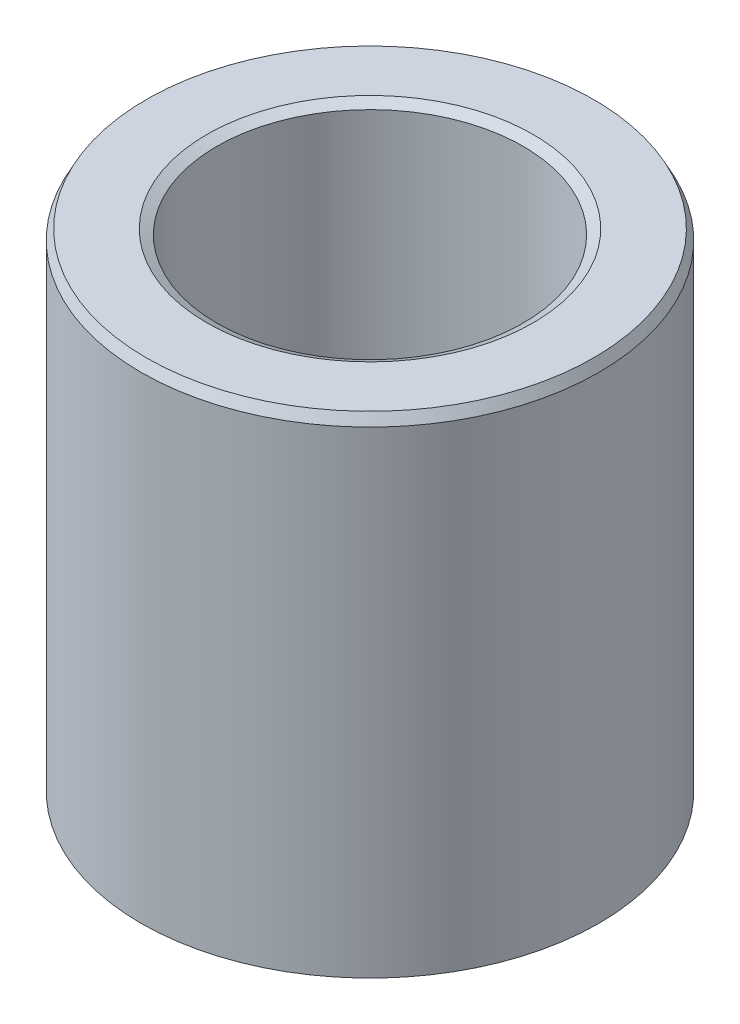
ISO-10303-21;
HEADER;
FILE_DESCRIPTION(('STEP AP214'),'2;1');
FILE_NAME('part.step','',(''),(''),'','','');
FILE_SCHEMA(('AUTOMOTIVE_DESIGN { 1 0 10303 214 1 1 1 1 }'));
ENDSEC;
DATA;
#1=APPLICATION_CONTEXT('core data for automotive mechanical design processes');
#2=APPLICATION_PROTOCOL_DEFINITION('international standard','automotive_design',2000,#1);
#3=PRODUCT_CONTEXT('',#1,'mechanical');
#4=PRODUCT('Part','Part','',(#3));
#5=PRODUCT_RELATED_PRODUCT_CATEGORY('part','',(#4));
#6=PRODUCT_DEFINITION_FORMATION('','',#4);
#7=PRODUCT_DEFINITION_CONTEXT('part definition',#1,'design');
#8=PRODUCT_DEFINITION('design','',#6,#7);
#9=PRODUCT_DEFINITION_SHAPE('','',#8);
#10=(LENGTH_UNIT() NAMED_UNIT(*) SI_UNIT(.MILLI.,.METRE.));
#11=(NAMED_UNIT(*) PLANE_ANGLE_UNIT() SI_UNIT($,.RADIAN.));
#12=(NAMED_UNIT(*) SI_UNIT($,.STERADIAN.) SOLID_ANGLE_UNIT());
#13=UNCERTAINTY_MEASURE_WITH_UNIT(LENGTH_MEASURE(1.E-05),#10,'distance_accuracy_value','');
#14=(GEOMETRIC_REPRESENTATION_CONTEXT(3) GLOBAL_UNCERTAINTY_ASSIGNED_CONTEXT((#13)) GLOBAL_UNIT_ASSIGNED_CONTEXT((#10,
#11,#12)) REPRESENTATION_CONTEXT('',''));
#15=CARTESIAN_POINT('',(0.,0.,0.));
#16=DIRECTION('',(0.,0.,1.));
#17=DIRECTION('',(1.,0.,0.));
#18=AXIS2_PLACEMENT_3D('',#15,#16,#17);
#19=CARTESIAN_POINT('',(0.,107.539626677391,0.));
#20=DIRECTION('',(0.,-1.,0.));
#21=DIRECTION('',(0.,0.,-1.));
#22=AXIS2_PLACEMENT_3D('',#19,#20,#21);
#23=CYLINDRICAL_SURFACE('',#22,50.);
#24=CARTESIAN_POINT('',(0.,1.13854864580681,0.));
#25=DIRECTION('',(0.,1.,0.));
#26=DIRECTION('',(0.,0.,1.));
#27=AXIS2_PLACEMENT_3D('',#24,#25,#26);
#28=CIRCLE('',#27,50.);
#29=CARTESIAN_POINT('',(0.,1.13854864580681,50.));
#30=VERTEX_POINT('',#29);
#31=EDGE_CURVE('E10',#30,#30,#28,.T.);
#32=ORIENTED_EDGE('',*,*,#31,.T.);
#33=EDGE_LOOP('',(#32));
#34=FACE_BOUND('',#33,.T.);
#35=CARTESIAN_POINT('',(0.,105.355182467018,0.));
#36=DIRECTION('',(0.,1.,0.));
#37=DIRECTION('',(0.,0.,1.));
#38=AXIS2_PLACEMENT_3D('',#35,#36,#37);
#39=CIRCLE('',#38,50.);
#40=CARTESIAN_POINT('',(0.,105.355182467018,50.));
#41=VERTEX_POINT('',#40);
#42=EDGE_CURVE('E50',#41,#41,#39,.F.);
#43=ORIENTED_EDGE('',*,*,#42,.T.);
#44=EDGE_LOOP('',(#43));
#45=FACE_BOUND('',#44,.T.);
#46=ADVANCED_FACE('F39',(#34,#45),#23,.T.);
#47=CARTESIAN_POINT('',(0.,107.539626677391,0.));
#48=DIRECTION('',(0.,1.,0.));
#49=DIRECTION('',(0.,0.,1.));
#50=AXIS2_PLACEMENT_3D('',#47,#48,#49);
#51=PLANE('',#50);
#52=CARTESIAN_POINT('',(0.,107.539626677391,0.));
#53=DIRECTION('',(0.,1.,0.));
#54=DIRECTION('',(0.,0.,1.));
#55=AXIS2_PLACEMENT_3D('',#52,#53,#54);
#56=CIRCLE('',#55,35.6407967585766);
#57=CARTESIAN_POINT('',(0.,107.539626677391,35.6407967585766));
#58=VERTEX_POINT('',#57);
#59=EDGE_CURVE('E58',#58,#58,#56,.F.);
#60=ORIENTED_EDGE('',*,*,#59,.T.);
#61=EDGE_LOOP('',(#60));
#62=FACE_BOUND('',#61,.T.);
#63=CARTESIAN_POINT('',(0.,107.539626677391,0.));
#64=DIRECTION('',(0.,1.,0.));
#65=DIRECTION('',(0.,0.,1.));
#66=AXIS2_PLACEMENT_3D('',#63,#64,#65);
#67=CIRCLE('',#66,48.8614513541932);
#68=CARTESIAN_POINT('',(0.,107.539626677391,48.8614513541932));
#69=VERTEX_POINT('',#68);
#70=EDGE_CURVE('E61',#69,#69,#67,.T.);
#71=ORIENTED_EDGE('',*,*,#70,.T.);
#72=EDGE_LOOP('',(#71));
#73=FACE_BOUND('',#72,.T.);
#74=ADVANCED_FACE('F88',(#62,#73),#51,.T.);
#75=CARTESIAN_POINT('',(0.,0.,0.));
#76=DIRECTION('',(0.,1.,0.));
#77=DIRECTION('',(0.,0.,1.));
#78=AXIS2_PLACEMENT_3D('',#75,#76,#77);
#79=PLANE('',#78);
#80=CARTESIAN_POINT('',(0.,0.,0.));
#81=DIRECTION('',(0.,1.,0.));
#82=DIRECTION('',(0.,0.,1.));
#83=AXIS2_PLACEMENT_3D('',#80,#81,#82);
#84=CIRCLE('',#83,34.5949011940108);
#85=CARTESIAN_POINT('',(0.,0.,34.5949011940108));
#86=VERTEX_POINT('',#85);
#87=EDGE_CURVE('E51',#86,#86,#84,.T.);
#88=ORIENTED_EDGE('',*,*,#87,.T.);
#89=EDGE_LOOP('',(#88));
#90=FACE_BOUND('',#89,.T.);
#91=CARTESIAN_POINT('',(0.,0.,0.));
#92=DIRECTION('',(0.,1.,0.));
#93=DIRECTION('',(0.,0.,1.));
#94=AXIS2_PLACEMENT_3D('',#91,#92,#93);
#95=CIRCLE('',#94,47.8155557896274);
#96=CARTESIAN_POINT('',(0.,0.,47.8155557896274));
#97=VERTEX_POINT('',#96);
#98=EDGE_CURVE('E54',#97,#97,#95,.F.);
#99=ORIENTED_EDGE('',*,*,#98,.T.);
#100=EDGE_LOOP('',(#99));
#101=FACE_BOUND('',#100,.T.);
#102=ADVANCED_FACE('F83',(#90,#101),#79,.F.);
#103=CARTESIAN_POINT('',(0.,107.539626677391,0.));
#104=DIRECTION('',(0.,-1.,0.));
#105=DIRECTION('',(0.,0.,-1.));
#106=AXIS2_PLACEMENT_3D('',#103,#104,#105);
#107=CYLINDRICAL_SURFACE('',#106,33.456352548204);
#108=CARTESIAN_POINT('',(0.,106.401078031584,0.));
#109=DIRECTION('',(0.,1.,0.));
#110=DIRECTION('',(0.,0.,1.));
#111=AXIS2_PLACEMENT_3D('',#108,#109,#110);
#112=CIRCLE('',#111,33.456352548204);
#113=CARTESIAN_POINT('',(0.,106.401078031584,33.456352548204));
#114=VERTEX_POINT('',#113);
#115=EDGE_CURVE('E67',#114,#114,#112,.T.);
#116=ORIENTED_EDGE('',*,*,#115,.T.);
#117=EDGE_LOOP('',(#116));
#118=FACE_BOUND('',#117,.T.);
#119=CARTESIAN_POINT('',(0.,2.18444421037264,0.));
#120=DIRECTION('',(0.,1.,0.));
#121=DIRECTION('',(0.,0.,1.));
#122=AXIS2_PLACEMENT_3D('',#119,#120,#121);
#123=CIRCLE('',#122,33.456352548204);
#124=CARTESIAN_POINT('',(0.,2.18444421037264,33.456352548204));
#125=VERTEX_POINT('',#124);
#126=EDGE_CURVE('E69',#125,#125,#123,.F.);
#127=ORIENTED_EDGE('',*,*,#126,.T.);
#128=EDGE_LOOP('',(#127));
#129=FACE_BOUND('',#128,.T.);
#130=ADVANCED_FACE('F71',(#118,#129),#107,.F.);
#131=CARTESIAN_POINT('',(0.,106.401078031584,0.));
#132=DIRECTION('',(0.,1.,0.));
#133=DIRECTION('',(0.,0.,1.));
#134=AXIS2_PLACEMENT_3D('',#131,#132,#133);
#135=CONICAL_SURFACE('',#134,33.456352548204,1.09032703819195);
#136=CARTESIAN_POINT('',(0.,107.539626677391,35.6407967585766));
#137=CARTESIAN_POINT('',(0.,107.527766795664,35.6180421313853));
#138=CARTESIAN_POINT('',(0.,107.515906913936,35.5952875041939));
#139=CARTESIAN_POINT('',(0.,107.492187150482,35.5497782498111));
#140=CARTESIAN_POINT('',(0.,107.480327268755,35.5270236226197));
#141=CARTESIAN_POINT('',(0.,107.456607505301,35.481514368237));
#142=CARTESIAN_POINT('',(0.,107.444747623574,35.4587597410456));
#143=CARTESIAN_POINT('',(0.,107.421027860119,35.4132504866628));
#144=CARTESIAN_POINT('',(0.,107.409167978392,35.3904958594714));
#145=CARTESIAN_POINT('',(0.,107.385448214938,35.3449866050887));
#146=CARTESIAN_POINT('',(0.,107.373588333211,35.3222319778973));
#147=CARTESIAN_POINT('',(0.,107.349868569756,35.2767227235145));
#148=CARTESIAN_POINT('',(0.,107.338008688029,35.2539680963231));
#149=CARTESIAN_POINT('',(0.,107.314288924575,35.2084588419404));
#150=CARTESIAN_POINT('',(0.,107.302429042848,35.185704214749));
#151=CARTESIAN_POINT('',(0.,107.278709279393,35.1401949603662));
#152=CARTESIAN_POINT('',(0.,107.266849397666,35.1174403331748));
#153=CARTESIAN_POINT('',(0.,107.243129634212,35.0719310787921));
#154=CARTESIAN_POINT('',(0.,107.231269752485,35.0491764516007));
#155=CARTESIAN_POINT('',(0.,107.20754998903,35.0036671972179));
#156=CARTESIAN_POINT('',(0.,107.195690107303,34.9809125700266));
#157=CARTESIAN_POINT('',(0.,107.171970343849,34.9354033156438));
#158=CARTESIAN_POINT('',(0.,107.160110462122,34.9126486884524));
#159=CARTESIAN_POINT('',(0.,107.136390698667,34.8671394340696));
#160=CARTESIAN_POINT('',(0.,107.12453081694,34.8443848068783));
#161=CARTESIAN_POINT('',(0.,107.100811053486,34.7988755524955));
#162=CARTESIAN_POINT('',(0.,107.088951171759,34.7761209253041));
#163=CARTESIAN_POINT('',(0.,107.065231408305,34.7306116709214));
#164=CARTESIAN_POINT('',(0.,107.053371526577,34.70785704373));
#165=CARTESIAN_POINT('',(0.,107.029651763123,34.6623477893472));
#166=CARTESIAN_POINT('',(0.,107.017791881396,34.6395931621558));
#167=CARTESIAN_POINT('',(0.,106.994072117942,34.5940839077731));
#168=CARTESIAN_POINT('',(0.,106.982212236214,34.5713292805817));
#169=CARTESIAN_POINT('',(0.,106.95849247276,34.5258200261989));
#170=CARTESIAN_POINT('',(0.,106.946632591033,34.5030653990075));
#171=CARTESIAN_POINT('',(0.,106.922912827579,34.4575561446248));
#172=CARTESIAN_POINT('',(0.,106.911052945852,34.4348015174334));
#173=CARTESIAN_POINT('',(0.,106.887333182397,34.3892922630506));
#174=CARTESIAN_POINT('',(0.,106.87547330067,34.3665376358592));
#175=CARTESIAN_POINT('',(0.,106.851753537216,34.3210283814765));
#176=CARTESIAN_POINT('',(0.,106.839893655489,34.2982737542851));
#177=CARTESIAN_POINT('',(0.,106.816173892034,34.2527644999023));
#178=CARTESIAN_POINT('',(0.,106.804314010307,34.230009872711));
#179=CARTESIAN_POINT('',(0.,106.780594246853,34.1845006183282));
#180=CARTESIAN_POINT('',(0.,106.768734365126,34.1617459911368));
#181=CARTESIAN_POINT('',(0.,106.745014601671,34.116236736754));
#182=CARTESIAN_POINT('',(0.,106.733154719944,34.0934821095627));
#183=CARTESIAN_POINT('',(0.,106.70943495649,34.0479728551799));
#184=CARTESIAN_POINT('',(0.,106.697575074763,34.0252182279885));
#185=CARTESIAN_POINT('',(0.,106.673855311308,33.9797089736057));
#186=CARTESIAN_POINT('',(0.,106.661995429581,33.9569543464144));
#187=CARTESIAN_POINT('',(0.,106.638275666127,33.9114450920316));
#188=CARTESIAN_POINT('',(0.,106.6264157844,33.8886904648402));
#189=CARTESIAN_POINT('',(0.,106.602696020946,33.8431812104575));
#190=CARTESIAN_POINT('',(0.,106.590836139218,33.8204265832661));
#191=CARTESIAN_POINT('',(0.,106.567116375764,33.7749173288833));
#192=CARTESIAN_POINT('',(0.,106.555256494037,33.7521627016919));
#193=CARTESIAN_POINT('',(0.,106.531536730583,33.7066534473092));
#194=CARTESIAN_POINT('',(0.,106.519676848855,33.6838988201178));
#195=CARTESIAN_POINT('',(0.,106.495957085401,33.638389565735));
#196=CARTESIAN_POINT('',(0.,106.484097203674,33.6156349385436));
#197=CARTESIAN_POINT('',(0.,106.46037744022,33.5701256841609));
#198=CARTESIAN_POINT('',(0.,106.448517558493,33.5473710569695));
#199=CARTESIAN_POINT('',(0.,106.424797795038,33.5018618025867));
#200=CARTESIAN_POINT('',(0.,106.412937913311,33.4791071753953));
#201=CARTESIAN_POINT('',(0.,106.401078031584,33.456352548204));
#202=B_SPLINE_CURVE_WITH_KNOTS('',3,(#136,#137,#138,#139,#140,#141,#142,#143,#144,#145,#146,
#147,#148,#149,#150,#151,#152,#153,#154,#155,#156,#157,#158,#159,#160,#161,#162,#163,#164,#165,
#166,#167,#168,#169,#170,#171,#172,#173,#174,#175,#176,#177,#178,#179,#180,#181,#182,#183,#184,
#185,#186,#187,#188,#189,#190,#191,#192,#193,#194,#195,#196,#197,#198,#199,#200,#201),
.UNSPECIFIED.,.F.,.F.,(4,2,2,2,2,2,2,2,2,2,2,2,2,2,2,2,2,2,2,2,2,2,2,2,2,2,2,2,2,2,2,2,4),(0.,
0.0769796640601104,0.153959328120221,0.230938992180338,0.307918656240448,0.384898320300565,
0.461877984360675,0.538857648420792,0.615837312480903,0.692816976541013,0.76979664060113,
0.84677630466124,0.923755968721357,1.00073563278147,1.07771529684158,1.15469496090169,
1.23167462496181,1.30865428902192,1.38563395308203,1.46261361714215,1.53959328120226,
1.61657294526238,1.69355260932249,1.7705322733826,1.84751193744271,1.92449160150282,
2.00147126556294,2.07845092962305,2.15543059368317,2.23241025774328,2.30938992180339,
2.38636958586351,2.46334924992362),.UNSPECIFIED.);
#203=EDGE_CURVE('BSEAM77',#58,#114,#202,.T.);
#204=ORIENTED_EDGE('',*,*,#59,.F.);
#205=ORIENTED_EDGE('',*,*,#115,.F.);
#206=ORIENTED_EDGE('',*,*,#203,.T.);
#207=ORIENTED_EDGE('',*,*,#203,.F.);
#208=EDGE_LOOP('',(#204,#206,#205,#207));
#209=FACE_BOUND('',#208,.T.);
#210=ADVANCED_FACE('F77',(#209),#135,.F.);
#211=CARTESIAN_POINT('',(0.,0.,0.));
#212=DIRECTION('',(0.,-1.,0.));
#213=DIRECTION('',(0.,0.,-1.));
#214=AXIS2_PLACEMENT_3D('',#211,#212,#213);
#215=CONICAL_SURFACE('',#214,34.5949011940108,0.480469288602949);
#216=ORIENTED_EDGE('',*,*,#126,.F.);
#217=EDGE_LOOP('',(#216));
#218=FACE_BOUND('',#217,.T.);
#219=ORIENTED_EDGE('',*,*,#87,.F.);
#220=EDGE_LOOP('',(#219));
#221=FACE_BOUND('',#220,.T.);
#222=ADVANCED_FACE('F73',(#218,#221),#215,.F.);
#223=CARTESIAN_POINT('',(0.,1.13854864580681,0.));
#224=DIRECTION('',(0.,1.,0.));
#225=DIRECTION('',(0.,0.,1.));
#226=AXIS2_PLACEMENT_3D('',#223,#224,#225);
#227=CONICAL_SURFACE('',#226,50.,1.09032703819194);
#228=ORIENTED_EDGE('',*,*,#98,.F.);
#229=EDGE_LOOP('',(#228));
#230=FACE_BOUND('',#229,.T.);
#231=ORIENTED_EDGE('',*,*,#31,.F.);
#232=EDGE_LOOP('',(#231));
#233=FACE_BOUND('',#232,.T.);
#234=ADVANCED_FACE('F76',(#230,#233),#227,.T.);
#235=CARTESIAN_POINT('',(0.,107.539626677391,0.));
#236=DIRECTION('',(0.,-1.,0.));
#237=DIRECTION('',(0.,0.,-1.));
#238=AXIS2_PLACEMENT_3D('',#235,#236,#237);
#239=CONICAL_SURFACE('',#238,48.8614513541932,0.480469288602944);
#240=ORIENTED_EDGE('',*,*,#42,.F.);
#241=EDGE_LOOP('',(#240));
#242=FACE_BOUND('',#241,.T.);
#243=ORIENTED_EDGE('',*,*,#70,.F.);
#244=EDGE_LOOP('',(#243));
#245=FACE_BOUND('',#244,.T.);
#246=ADVANCED_FACE('F45',(#242,#245),#239,.T.);
#247=CLOSED_SHELL('',(#46,#74,#102,#130,#210,#222,#234,#246));
#248=MANIFOLD_SOLID_BREP('B2',#247);
#249=ADVANCED_BREP_SHAPE_REPRESENTATION('',(#18,#248),#14);
#250=SHAPE_DEFINITION_REPRESENTATION(#9,#249);
ENDSEC;
END-ISO-10303-21;
